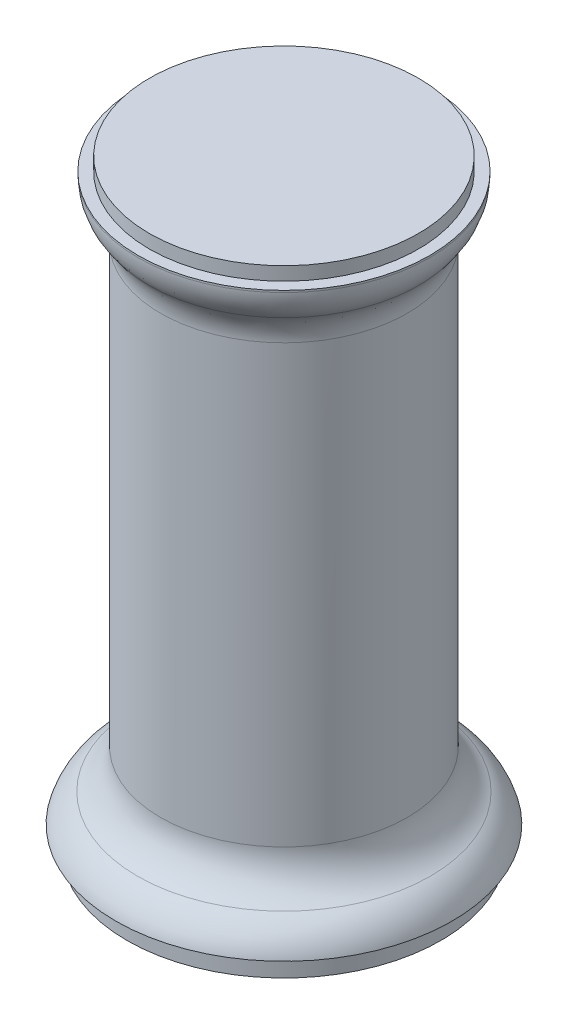
ISO-10303-21;
HEADER;
FILE_DESCRIPTION(('STEP AP214'),'2;1');
FILE_NAME('part.step','',(''),(''),'','','');
FILE_SCHEMA(('AUTOMOTIVE_DESIGN { 1 0 10303 214 1 1 1 1 }'));
ENDSEC;
DATA;
#1=APPLICATION_CONTEXT('core data for automotive mechanical design processes');
#2=APPLICATION_PROTOCOL_DEFINITION('international standard','automotive_design',2000,#1);
#3=PRODUCT_CONTEXT('',#1,'mechanical');
#4=PRODUCT('Part','Part','',(#3));
#5=PRODUCT_RELATED_PRODUCT_CATEGORY('part','',(#4));
#6=PRODUCT_DEFINITION_FORMATION('','',#4);
#7=PRODUCT_DEFINITION_CONTEXT('part definition',#1,'design');
#8=PRODUCT_DEFINITION('design','',#6,#7);
#9=PRODUCT_DEFINITION_SHAPE('','',#8);
#10=(LENGTH_UNIT() NAMED_UNIT(*) SI_UNIT(.MILLI.,.METRE.));
#11=(NAMED_UNIT(*) PLANE_ANGLE_UNIT() SI_UNIT($,.RADIAN.));
#12=(NAMED_UNIT(*) SI_UNIT($,.STERADIAN.) SOLID_ANGLE_UNIT());
#13=UNCERTAINTY_MEASURE_WITH_UNIT(LENGTH_MEASURE(1.E-05),#10,'distance_accuracy_value','');
#14=(GEOMETRIC_REPRESENTATION_CONTEXT(3) GLOBAL_UNCERTAINTY_ASSIGNED_CONTEXT((#13)) GLOBAL_UNIT_ASSIGNED_CONTEXT((#10,
#11,#12)) REPRESENTATION_CONTEXT('',''));
#15=CARTESIAN_POINT('',(0.,0.,0.));
#16=DIRECTION('',(0.,0.,1.));
#17=DIRECTION('',(1.,0.,0.));
#18=AXIS2_PLACEMENT_3D('',#15,#16,#17);
#19=CARTESIAN_POINT('',(0.,5.,0.));
#20=DIRECTION('',(0.,-1.,0.));
#21=DIRECTION('',(0.,0.,-1.));
#22=AXIS2_PLACEMENT_3D('',#19,#20,#21);
#23=CYLINDRICAL_SURFACE('',#22,35.);
#24=CARTESIAN_POINT('',(0.,5.,0.));
#25=DIRECTION('',(0.,1.,0.));
#26=DIRECTION('',(0.,0.,1.));
#27=AXIS2_PLACEMENT_3D('',#24,#25,#26);
#28=CIRCLE('',#27,35.);
#29=CARTESIAN_POINT('',(0.,5.,35.));
#30=VERTEX_POINT('',#29);
#31=EDGE_CURVE('E53',#30,#30,#28,.T.);
#32=ORIENTED_EDGE('',*,*,#31,.F.);
#33=EDGE_LOOP('',(#32));
#34=FACE_BOUND('',#33,.T.);
#35=CARTESIAN_POINT('',(0.,0.,0.));
#36=DIRECTION('',(0.,1.,0.));
#37=DIRECTION('',(0.,0.,1.));
#38=AXIS2_PLACEMENT_3D('',#35,#36,#37);
#39=CIRCLE('',#38,35.);
#40=CARTESIAN_POINT('',(0.,0.,35.));
#41=VERTEX_POINT('',#40);
#42=EDGE_CURVE('E54',#41,#41,#39,.T.);
#43=ORIENTED_EDGE('',*,*,#42,.T.);
#44=EDGE_LOOP('',(#43));
#45=FACE_BOUND('',#44,.T.);
#46=ADVANCED_FACE('F30',(#34,#45),#23,.T.);
#47=CARTESIAN_POINT('',(0.,0.,0.));
#48=DIRECTION('',(0.,1.,0.));
#49=DIRECTION('',(0.,0.,1.));
#50=AXIS2_PLACEMENT_3D('',#47,#48,#49);
#51=PLANE('',#50);
#52=ORIENTED_EDGE('',*,*,#42,.F.);
#53=EDGE_LOOP('',(#52));
#54=FACE_BOUND('',#53,.T.);
#55=ADVANCED_FACE('F97',(#54),#51,.F.);
#56=CARTESIAN_POINT('',(0.,5.,0.));
#57=DIRECTION('',(0.,1.,0.));
#58=DIRECTION('',(0.,0.,1.));
#59=AXIS2_PLACEMENT_3D('',#56,#57,#58);
#60=PLANE('',#59);
#61=ORIENTED_EDGE('',*,*,#31,.T.);
#62=EDGE_LOOP('',(#61));
#63=FACE_BOUND('',#62,.T.);
#64=CARTESIAN_POINT('',(0.,5.,0.));
#65=DIRECTION('',(0.,1.,0.));
#66=DIRECTION('',(0.,0.,1.));
#67=AXIS2_PLACEMENT_3D('',#64,#65,#66);
#68=CIRCLE('',#67,37.5);
#69=CARTESIAN_POINT('',(0.,5.,37.5));
#70=VERTEX_POINT('',#69);
#71=EDGE_CURVE('E57',#70,#70,#68,.T.);
#72=ORIENTED_EDGE('',*,*,#71,.F.);
#73=EDGE_LOOP('',(#72));
#74=FACE_BOUND('',#73,.T.);
#75=ADVANCED_FACE('F93',(#63,#74),#60,.F.);
#76=CARTESIAN_POINT('',(0.,126.,0.));
#77=DIRECTION('',(0.,-1.,0.));
#78=DIRECTION('',(0.,0.,-1.));
#79=AXIS2_PLACEMENT_3D('',#76,#77,#78);
#80=CYLINDRICAL_SURFACE('',#79,27.5);
#81=CARTESIAN_POINT('',(0.,117.339745962156,0.));
#82=DIRECTION('',(0.,1.,0.));
#83=DIRECTION('',(0.,0.,1.));
#84=AXIS2_PLACEMENT_3D('',#81,#82,#83);
#85=CIRCLE('',#84,27.5);
#86=CARTESIAN_POINT('',(0.,117.339745962156,-27.5));
#87=VERTEX_POINT('',#86);
#88=EDGE_CURVE('E45',#87,#87,#85,.F.);
#89=CARTESIAN_POINT('',(0.,20.,0.));
#90=DIRECTION('',(0.,1.,0.));
#91=DIRECTION('',(0.,0.,1.));
#92=AXIS2_PLACEMENT_3D('',#89,#90,#91);
#93=CIRCLE('',#92,27.5);
#94=CARTESIAN_POINT('',(0.,20.,-27.5));
#95=VERTEX_POINT('',#94);
#96=EDGE_CURVE('E50',#95,#95,#93,.T.);
#97=CARTESIAN_POINT('',(0.,117.339745962156,-27.5));
#98=CARTESIAN_POINT('',(0.,116.32579027505,-27.5));
#99=CARTESIAN_POINT('',(0.,115.311834587944,-27.5));
#100=CARTESIAN_POINT('',(0.,113.283923213732,-27.5));
#101=CARTESIAN_POINT('',(0.,112.269967526627,-27.5));
#102=CARTESIAN_POINT('',(0.,110.242056152415,-27.5));
#103=CARTESIAN_POINT('',(0.,109.228100465309,-27.5));
#104=CARTESIAN_POINT('',(0.,107.200189091098,-27.5));
#105=CARTESIAN_POINT('',(0.,106.186233403992,-27.5));
#106=CARTESIAN_POINT('',(0.,104.15832202978,-27.5));
#107=CARTESIAN_POINT('',(0.,103.144366342675,-27.5));
#108=CARTESIAN_POINT('',(0.,101.116454968463,-27.5));
#109=CARTESIAN_POINT('',(0.,100.102499281357,-27.5));
#110=CARTESIAN_POINT('',(0.,98.0745879071456,-27.5));
#111=CARTESIAN_POINT('',(0.,97.0606322200398,-27.5));
#112=CARTESIAN_POINT('',(0.,95.0327208458283,-27.5));
#113=CARTESIAN_POINT('',(0.,94.0187651587225,-27.5));
#114=CARTESIAN_POINT('',(0.,91.9908537845109,-27.5));
#115=CARTESIAN_POINT('',(0.,90.9768980974051,-27.5));
#116=CARTESIAN_POINT('',(0.,88.9489867231936,-27.5));
#117=CARTESIAN_POINT('',(0.,87.9350310360878,-27.5));
#118=CARTESIAN_POINT('',(0.,85.9071196618762,-27.5));
#119=CARTESIAN_POINT('',(0.,84.8931639747704,-27.5));
#120=CARTESIAN_POINT('',(0.,82.8652526005588,-27.5));
#121=CARTESIAN_POINT('',(0.,81.851296913453,-27.5));
#122=CARTESIAN_POINT('',(0.,79.8233855392415,-27.5));
#123=CARTESIAN_POINT('',(0.,78.8094298521357,-27.5));
#124=CARTESIAN_POINT('',(0.,76.7815184779241,-27.5));
#125=CARTESIAN_POINT('',(0.,75.7675627908183,-27.5));
#126=CARTESIAN_POINT('',(0.,73.7396514166067,-27.5));
#127=CARTESIAN_POINT('',(0.,72.725695729501,-27.5));
#128=CARTESIAN_POINT('',(0.,70.6977843552894,-27.5));
#129=CARTESIAN_POINT('',(0.,69.6838286681836,-27.5));
#130=CARTESIAN_POINT('',(0.,67.655917293972,-27.5));
#131=CARTESIAN_POINT('',(0.,66.6419616068662,-27.5));
#132=CARTESIAN_POINT('',(0.,64.6140502326547,-27.5));
#133=CARTESIAN_POINT('',(0.,63.6000945455489,-27.5));
#134=CARTESIAN_POINT('',(0.,61.5721831713373,-27.5));
#135=CARTESIAN_POINT('',(0.,60.5582274842315,-27.5));
#136=CARTESIAN_POINT('',(0.,58.5303161100199,-27.5));
#137=CARTESIAN_POINT('',(0.,57.5163604229142,-27.5));
#138=CARTESIAN_POINT('',(0.,55.4884490487026,-27.5));
#139=CARTESIAN_POINT('',(0.,54.4744933615968,-27.5));
#140=CARTESIAN_POINT('',(0.,52.4465819873852,-27.5));
#141=CARTESIAN_POINT('',(0.,51.4326263002794,-27.5));
#142=CARTESIAN_POINT('',(0.,49.4047149260678,-27.5));
#143=CARTESIAN_POINT('',(0.,48.3907592389621,-27.5));
#144=CARTESIAN_POINT('',(0.,46.3628478647505,-27.5));
#145=CARTESIAN_POINT('',(0.,45.3488921776447,-27.5));
#146=CARTESIAN_POINT('',(0.,43.3209808034331,-27.5));
#147=CARTESIAN_POINT('',(0.,42.3070251163273,-27.5));
#148=CARTESIAN_POINT('',(0.,40.2791137421158,-27.5));
#149=CARTESIAN_POINT('',(0.,39.26515805501,-27.5));
#150=CARTESIAN_POINT('',(0.,37.2372466807984,-27.5));
#151=CARTESIAN_POINT('',(0.,36.2232909936926,-27.5));
#152=CARTESIAN_POINT('',(0.,34.195379619481,-27.5));
#153=CARTESIAN_POINT('',(0.,33.1814239323753,-27.5));
#154=CARTESIAN_POINT('',(0.,31.1535125581637,-27.5));
#155=CARTESIAN_POINT('',(0.,30.1395568710579,-27.5));
#156=CARTESIAN_POINT('',(0.,28.1116454968463,-27.5));
#157=CARTESIAN_POINT('',(0.,27.0976898097405,-27.5));
#158=CARTESIAN_POINT('',(0.,25.069778435529,-27.5));
#159=CARTESIAN_POINT('',(0.,24.0558227484232,-27.5));
#160=CARTESIAN_POINT('',(0.,22.0279113742116,-27.5));
#161=CARTESIAN_POINT('',(0.,21.0139556871058,-27.5));
#162=CARTESIAN_POINT('',(0.,20.,-27.5));
#163=B_SPLINE_CURVE_WITH_KNOTS('',3,(#97,#98,#99,#100,#101,#102,#103,#104,#105,#106,#107,#108,
#109,#110,#111,#112,#113,#114,#115,#116,#117,#118,#119,#120,#121,#122,#123,#124,#125,#126,#127,
#128,#129,#130,#131,#132,#133,#134,#135,#136,#137,#138,#139,#140,#141,#142,#143,#144,#145,#146,
#147,#148,#149,#150,#151,#152,#153,#154,#155,#156,#157,#158,#159,#160,#161,#162),.UNSPECIFIED.,
.F.,.F.,(4,2,2,2,2,2,2,2,2,2,2,2,2,2,2,2,2,2,2,2,2,2,2,2,2,2,2,2,2,2,2,2,4),(0.,
3.04186706131737,6.08373412263473,9.12560118395209,12.1674682452695,15.2093353065868,
18.2512023679042,21.2930694292215,24.3349364905389,27.3768035518563,30.4186706131736,
33.460537674491,36.5024047358084,39.5442717971257,42.5861388584431,45.6280059197604,
48.6698729810778,51.7117400423952,54.7536071037125,57.7954741650299,60.8373412263472,
63.8792082876646,66.921075348982,69.9629424102993,73.0048094716167,76.0466765329341,
79.0885435942514,82.1304106555688,85.1722777168862,88.2141447782035,91.2560118395209,
94.2978789008382,97.3397459621556),.UNSPECIFIED.);
#164=EDGE_CURVE('BSEAM88',#87,#95,#163,.T.);
#165=ORIENTED_EDGE('',*,*,#88,.T.);
#166=ORIENTED_EDGE('',*,*,#96,.T.);
#167=ORIENTED_EDGE('',*,*,#164,.T.);
#168=ORIENTED_EDGE('',*,*,#164,.F.);
#169=EDGE_LOOP('',(#165,#167,#166,#168));
#170=FACE_BOUND('',#169,.T.);
#171=ADVANCED_FACE('F88',(#170),#80,.T.);
#172=CARTESIAN_POINT('',(0.,131.,0.));
#173=DIRECTION('',(0.,-1.,0.));
#174=DIRECTION('',(0.,0.,-1.));
#175=AXIS2_PLACEMENT_3D('',#172,#173,#174);
#176=CYLINDRICAL_SURFACE('',#175,32.5);
#177=CARTESIAN_POINT('',(0.,130.568502517479,0.));
#178=DIRECTION('',(0.,-1.,0.));
#179=DIRECTION('',(0.,0.,-1.));
#180=AXIS2_PLACEMENT_3D('',#177,#178,#179);
#181=CIRCLE('',#180,32.5);
#182=CARTESIAN_POINT('',(0.,130.568502517479,-32.5));
#183=VERTEX_POINT('',#182);
#184=EDGE_CURVE('E37',#183,#183,#181,.F.);
#185=ORIENTED_EDGE('',*,*,#184,.T.);
#186=EDGE_LOOP('',(#185));
#187=FACE_BOUND('',#186,.T.);
#188=CARTESIAN_POINT('',(0.,131.,0.));
#189=DIRECTION('',(0.,1.,0.));
#190=DIRECTION('',(0.,0.,1.));
#191=AXIS2_PLACEMENT_3D('',#188,#189,#190);
#192=CIRCLE('',#191,32.5);
#193=CARTESIAN_POINT('',(0.,131.,32.5));
#194=VERTEX_POINT('',#193);
#195=EDGE_CURVE('E62',#194,#194,#192,.T.);
#196=ORIENTED_EDGE('',*,*,#195,.F.);
#197=EDGE_LOOP('',(#196));
#198=FACE_BOUND('',#197,.T.);
#199=ADVANCED_FACE('F83',(#187,#198),#176,.T.);
#200=CARTESIAN_POINT('',(0.,131.,0.));
#201=DIRECTION('',(0.,1.,0.));
#202=DIRECTION('',(0.,0.,1.));
#203=AXIS2_PLACEMENT_3D('',#200,#201,#202);
#204=PLANE('',#203);
#205=CARTESIAN_POINT('',(0.,131.,0.));
#206=DIRECTION('',(0.,1.,0.));
#207=DIRECTION('',(0.,0.,1.));
#208=AXIS2_PLACEMENT_3D('',#205,#206,#207);
#209=CIRCLE('',#208,30.);
#210=CARTESIAN_POINT('',(0.,131.,30.));
#211=VERTEX_POINT('',#210);
#212=EDGE_CURVE('E66',#211,#211,#209,.T.);
#213=ORIENTED_EDGE('',*,*,#212,.F.);
#214=EDGE_LOOP('',(#213));
#215=FACE_BOUND('',#214,.T.);
#216=ORIENTED_EDGE('',*,*,#195,.T.);
#217=EDGE_LOOP('',(#216));
#218=FACE_BOUND('',#217,.T.);
#219=ADVANCED_FACE('F77',(#215,#218),#204,.T.);
#220=CARTESIAN_POINT('',(0.,134.,0.));
#221=DIRECTION('',(0.,-1.,0.));
#222=DIRECTION('',(0.,0.,-1.));
#223=AXIS2_PLACEMENT_3D('',#220,#221,#222);
#224=CYLINDRICAL_SURFACE('',#223,30.);
#225=CARTESIAN_POINT('',(0.,134.,0.));
#226=DIRECTION('',(0.,1.,0.));
#227=DIRECTION('',(0.,0.,1.));
#228=AXIS2_PLACEMENT_3D('',#225,#226,#227);
#229=CIRCLE('',#228,30.);
#230=CARTESIAN_POINT('',(0.,134.,30.));
#231=VERTEX_POINT('',#230);
#232=EDGE_CURVE('E65',#231,#231,#229,.T.);
#233=ORIENTED_EDGE('',*,*,#232,.F.);
#234=EDGE_LOOP('',(#233));
#235=FACE_BOUND('',#234,.T.);
#236=ORIENTED_EDGE('',*,*,#212,.T.);
#237=EDGE_LOOP('',(#236));
#238=FACE_BOUND('',#237,.T.);
#239=ADVANCED_FACE('F74',(#235,#238),#224,.T.);
#240=CARTESIAN_POINT('',(0.,134.,0.));
#241=DIRECTION('',(0.,1.,0.));
#242=DIRECTION('',(0.,0.,1.));
#243=AXIS2_PLACEMENT_3D('',#240,#241,#242);
#244=PLANE('',#243);
#245=ORIENTED_EDGE('',*,*,#232,.T.);
#246=EDGE_LOOP('',(#245));
#247=FACE_BOUND('',#246,.T.);
#248=ADVANCED_FACE('F72',(#247),#244,.T.);
#249=CARTESIAN_POINT('',(0.,117.339745962156,0.));
#250=DIRECTION('',(0.,1.,0.));
#251=DIRECTION('',(0.,0.,1.));
#252=AXIS2_PLACEMENT_3D('',#249,#250,#251);
#253=TOROIDAL_SURFACE('',#252,37.5,10.);
#254=CARTESIAN_POINT('',(0.,123.954124239817,0.));
#255=DIRECTION('',(0.,-1.,0.));
#256=DIRECTION('',(0.,0.,-1.));
#257=AXIS2_PLACEMENT_3D('',#254,#255,#256);
#258=CIRCLE('',#257,30.);
#259=CARTESIAN_POINT('',(0.,123.954124239817,-30.));
#260=VERTEX_POINT('',#259);
#261=EDGE_CURVE('E10',#260,#260,#258,.T.);
#262=ORIENTED_EDGE('',*,*,#261,.T.);
#263=EDGE_LOOP('',(#262));
#264=FACE_BOUND('',#263,.T.);
#265=ORIENTED_EDGE('',*,*,#88,.F.);
#266=EDGE_LOOP('',(#265));
#267=FACE_BOUND('',#266,.T.);
#268=ADVANCED_FACE('F109',(#264,#267),#253,.F.);
#269=CARTESIAN_POINT('',(0.,20.,0.));
#270=DIRECTION('',(0.,1.,0.));
#271=DIRECTION('',(0.,0.,1.));
#272=AXIS2_PLACEMENT_3D('',#269,#270,#271);
#273=TOROIDAL_SURFACE('',#272,37.5,10.);
#274=CARTESIAN_POINT('',(0.,11.2499999999999,0.));
#275=DIRECTION('',(0.,1.,0.));
#276=DIRECTION('',(0.,0.,1.));
#277=AXIS2_PLACEMENT_3D('',#274,#275,#276);
#278=CIRCLE('',#277,32.6587708172407);
#279=CARTESIAN_POINT('',(0.,11.2499999999999,32.6587708172407));
#280=VERTEX_POINT('',#279);
#281=EDGE_CURVE('E41',#280,#280,#278,.T.);
#282=ORIENTED_EDGE('',*,*,#281,.T.);
#283=EDGE_LOOP('',(#282));
#284=FACE_BOUND('',#283,.T.);
#285=ORIENTED_EDGE('',*,*,#96,.F.);
#286=EDGE_LOOP('',(#285));
#287=FACE_BOUND('',#286,.T.);
#288=ADVANCED_FACE('F112',(#284,#287),#273,.F.);
#289=CARTESIAN_POINT('',(0.,2.5,0.));
#290=DIRECTION('',(0.,1.,0.));
#291=DIRECTION('',(0.,0.,1.));
#292=AXIS2_PLACEMENT_3D('',#289,#290,#291);
#293=TOROIDAL_SURFACE('',#292,27.8175416344815,10.);
#294=ORIENTED_EDGE('',*,*,#71,.T.);
#295=EDGE_LOOP('',(#294));
#296=FACE_BOUND('',#295,.T.);
#297=ORIENTED_EDGE('',*,*,#281,.F.);
#298=EDGE_LOOP('',(#297));
#299=FACE_BOUND('',#298,.T.);
#300=ADVANCED_FACE('F114',(#296,#299),#293,.T.);
#301=CARTESIAN_POINT('',(0.,130.568502517479,0.));
#302=DIRECTION('',(0.,-1.,0.));
#303=DIRECTION('',(0.,0.,-1.));
#304=AXIS2_PLACEMENT_3D('',#301,#302,#303);
#305=TOROIDAL_SURFACE('',#304,22.5,10.);
#306=ORIENTED_EDGE('',*,*,#261,.F.);
#307=EDGE_LOOP('',(#306));
#308=FACE_BOUND('',#307,.T.);
#309=ORIENTED_EDGE('',*,*,#184,.F.);
#310=EDGE_LOOP('',(#309));
#311=FACE_BOUND('',#310,.T.);
#312=ADVANCED_FACE('F32',(#308,#311),#305,.T.);
#313=CLOSED_SHELL('',(#46,#55,#75,#171,#199,#219,#239,#248,#268,#288,#300,#312));
#314=MANIFOLD_SOLID_BREP('B2',#313);
#315=ADVANCED_BREP_SHAPE_REPRESENTATION('',(#18,#314),#14);
#316=SHAPE_DEFINITION_REPRESENTATION(#9,#315);
ENDSEC;
END-ISO-10303-21;
